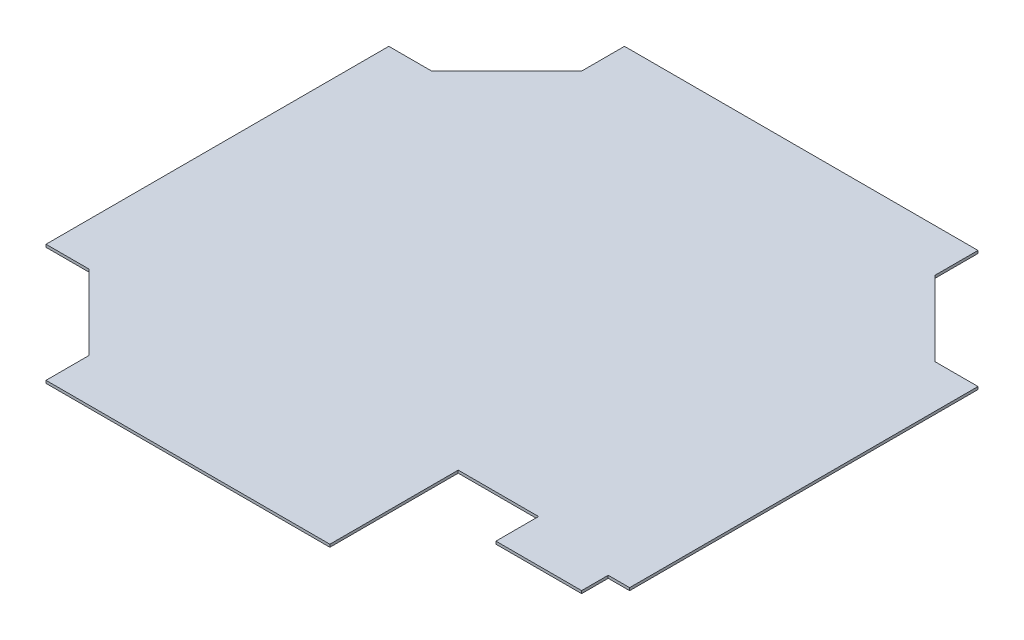
ISO-10303-21;
HEADER;
FILE_DESCRIPTION(('STEP AP214'),'2;1');
FILE_NAME('part.step','',(''),(''),'','','');
FILE_SCHEMA(('AUTOMOTIVE_DESIGN { 1 0 10303 214 1 1 1 1 }'));
ENDSEC;
DATA;
#1=APPLICATION_CONTEXT('core data for automotive mechanical design processes');
#2=APPLICATION_PROTOCOL_DEFINITION('international standard','automotive_design',2000,#1);
#3=PRODUCT_CONTEXT('',#1,'mechanical');
#4=PRODUCT('Part','Part','',(#3));
#5=PRODUCT_RELATED_PRODUCT_CATEGORY('part','',(#4));
#6=PRODUCT_DEFINITION_FORMATION('','',#4);
#7=PRODUCT_DEFINITION_CONTEXT('part definition',#1,'design');
#8=PRODUCT_DEFINITION('design','',#6,#7);
#9=PRODUCT_DEFINITION_SHAPE('','',#8);
#10=(LENGTH_UNIT() NAMED_UNIT(*) SI_UNIT(.MILLI.,.METRE.));
#11=(NAMED_UNIT(*) PLANE_ANGLE_UNIT() SI_UNIT($,.RADIAN.));
#12=(NAMED_UNIT(*) SI_UNIT($,.STERADIAN.) SOLID_ANGLE_UNIT());
#13=UNCERTAINTY_MEASURE_WITH_UNIT(LENGTH_MEASURE(1.E-05),#10,'distance_accuracy_value','');
#14=(GEOMETRIC_REPRESENTATION_CONTEXT(3) GLOBAL_UNCERTAINTY_ASSIGNED_CONTEXT((#13)) GLOBAL_UNIT_ASSIGNED_CONTEXT((#10,
#11,#12)) REPRESENTATION_CONTEXT('',''));
#15=CARTESIAN_POINT('',(0.,0.,0.));
#16=DIRECTION('',(0.,0.,1.));
#17=DIRECTION('',(1.,0.,0.));
#18=AXIS2_PLACEMENT_3D('',#15,#16,#17);
#19=CARTESIAN_POINT('',(349.25,3.175,342.9));
#20=DIRECTION('',(-1.,0.,0.));
#21=DIRECTION('',(0.,0.,1.));
#22=AXIS2_PLACEMENT_3D('',#19,#20,#21);
#23=PLANE('',#22);
#24=DIRECTION('',(0.,0.,-1.));
#25=VECTOR('',#24,1.);
#26=CARTESIAN_POINT('',(349.25,3.175,342.9));
#27=LINE('',#26,#25);
#28=CARTESIAN_POINT('',(349.25,3.17500000000009,209.804));
#29=VERTEX_POINT('',#28);
#30=CARTESIAN_POINT('',(349.25,3.175,-203.2));
#31=VERTEX_POINT('',#30);
#32=EDGE_CURVE('E302',#29,#31,#27,.T.);
#33=ORIENTED_EDGE('',*,*,#32,.F.);
#34=DIRECTION('',(0.,-1.,0.));
#35=VECTOR('',#34,1.);
#36=CARTESIAN_POINT('',(349.25,3.175,209.804));
#37=LINE('',#36,#35);
#38=CARTESIAN_POINT('',(349.25,0.,209.804));
#39=VERTEX_POINT('',#38);
#40=EDGE_CURVE('E221',#29,#39,#37,.T.);
#41=ORIENTED_EDGE('',*,*,#40,.T.);
#42=DIRECTION('',(0.,0.,-1.));
#43=VECTOR('',#42,1.);
#44=CARTESIAN_POINT('',(349.25,0.,342.9));
#45=LINE('',#44,#43);
#46=CARTESIAN_POINT('',(349.25,0.,-203.2));
#47=VERTEX_POINT('',#46);
#48=EDGE_CURVE('E296',#39,#47,#45,.T.);
#49=ORIENTED_EDGE('',*,*,#48,.T.);
#50=DIRECTION('',(0.,1.,0.));
#51=VECTOR('',#50,1.);
#52=CARTESIAN_POINT('',(349.25,0.,-203.2));
#53=LINE('',#52,#51);
#54=EDGE_CURVE('E224',#47,#31,#53,.T.);
#55=ORIENTED_EDGE('',*,*,#54,.T.);
#56=EDGE_LOOP('',(#33,#41,#49,#55));
#57=FACE_BOUND('',#56,.T.);
#58=ADVANCED_FACE('F39',(#57),#23,.F.);
#59=CARTESIAN_POINT('',(-349.25,3.175,-342.9));
#60=DIRECTION('',(0.,0.,1.));
#61=DIRECTION('',(1.,0.,0.));
#62=AXIS2_PLACEMENT_3D('',#59,#60,#61);
#63=PLANE('',#62);
#64=DIRECTION('',(-1.,0.,0.));
#65=VECTOR('',#64,1.);
#66=CARTESIAN_POINT('',(-349.25,3.175,-342.9));
#67=LINE('',#66,#65);
#68=CARTESIAN_POINT('',(209.55,3.175,-342.9));
#69=VERTEX_POINT('',#68);
#70=CARTESIAN_POINT('',(-209.55,3.175,-342.9));
#71=VERTEX_POINT('',#70);
#72=EDGE_CURVE('E304',#69,#71,#67,.T.);
#73=ORIENTED_EDGE('',*,*,#72,.F.);
#74=DIRECTION('',(0.,1.,0.));
#75=VECTOR('',#74,1.);
#76=CARTESIAN_POINT('',(209.55,0.,-342.9));
#77=LINE('',#76,#75);
#78=CARTESIAN_POINT('',(209.55,0.,-342.9));
#79=VERTEX_POINT('',#78);
#80=EDGE_CURVE('E253',#79,#69,#77,.T.);
#81=ORIENTED_EDGE('',*,*,#80,.F.);
#82=DIRECTION('',(-1.,0.,0.));
#83=VECTOR('',#82,1.);
#84=CARTESIAN_POINT('',(-349.25,0.,-342.9));
#85=LINE('',#84,#83);
#86=CARTESIAN_POINT('',(-209.55,0.,-342.9));
#87=VERTEX_POINT('',#86);
#88=EDGE_CURVE('E314',#79,#87,#85,.T.);
#89=ORIENTED_EDGE('',*,*,#88,.T.);
#90=DIRECTION('',(0.,1.,0.));
#91=VECTOR('',#90,1.);
#92=CARTESIAN_POINT('',(-209.55,0.,-342.9));
#93=LINE('',#92,#91);
#94=EDGE_CURVE('E293',#87,#71,#93,.T.);
#95=ORIENTED_EDGE('',*,*,#94,.T.);
#96=EDGE_LOOP('',(#73,#81,#89,#95));
#97=FACE_BOUND('',#96,.T.);
#98=ADVANCED_FACE('F356',(#97),#63,.F.);
#99=CARTESIAN_POINT('',(-349.25,3.175,342.9));
#100=DIRECTION('',(1.,0.,0.));
#101=DIRECTION('',(0.,0.,-1.));
#102=AXIS2_PLACEMENT_3D('',#99,#100,#101);
#103=PLANE('',#102);
#104=DIRECTION('',(0.,0.,1.));
#105=VECTOR('',#104,1.);
#106=CARTESIAN_POINT('',(-349.25,0.,342.9));
#107=LINE('',#106,#105);
#108=CARTESIAN_POINT('',(-349.25,0.,-203.2));
#109=VERTEX_POINT('',#108);
#110=CARTESIAN_POINT('',(-349.25,0.,203.2));
#111=VERTEX_POINT('',#110);
#112=EDGE_CURVE('E317',#109,#111,#107,.T.);
#113=ORIENTED_EDGE('',*,*,#112,.T.);
#114=DIRECTION('',(0.,1.,0.));
#115=VECTOR('',#114,1.);
#116=CARTESIAN_POINT('',(-349.25,0.,203.2));
#117=LINE('',#116,#115);
#118=CARTESIAN_POINT('',(-349.25,3.175,203.2));
#119=VERTEX_POINT('',#118);
#120=EDGE_CURVE('E232',#111,#119,#117,.T.);
#121=ORIENTED_EDGE('',*,*,#120,.T.);
#122=DIRECTION('',(0.,0.,1.));
#123=VECTOR('',#122,1.);
#124=CARTESIAN_POINT('',(-349.25,3.175,342.9));
#125=LINE('',#124,#123);
#126=CARTESIAN_POINT('',(-349.25,3.175,-203.2));
#127=VERTEX_POINT('',#126);
#128=EDGE_CURVE('E308',#127,#119,#125,.T.);
#129=ORIENTED_EDGE('',*,*,#128,.F.);
#130=DIRECTION('',(0.,1.,0.));
#131=VECTOR('',#130,1.);
#132=CARTESIAN_POINT('',(-349.25,0.,-203.2));
#133=LINE('',#132,#131);
#134=EDGE_CURVE('E286',#109,#127,#133,.T.);
#135=ORIENTED_EDGE('',*,*,#134,.F.);
#136=EDGE_LOOP('',(#113,#121,#129,#135));
#137=FACE_BOUND('',#136,.T.);
#138=ADVANCED_FACE('F337',(#137),#103,.F.);
#139=CARTESIAN_POINT('',(-349.25,3.175,342.9));
#140=DIRECTION('',(0.,0.,-1.));
#141=DIRECTION('',(-1.,0.,0.));
#142=AXIS2_PLACEMENT_3D('',#139,#140,#141);
#143=PLANE('',#142);
#144=DIRECTION('',(1.,0.,0.));
#145=VECTOR('',#144,1.);
#146=CARTESIAN_POINT('',(-349.25,0.,342.9));
#147=LINE('',#146,#145);
#148=CARTESIAN_POINT('',(-209.55,0.,342.9));
#149=VERTEX_POINT('',#148);
#150=CARTESIAN_POINT('',(126.999999999999,0.,342.9));
#151=VERTEX_POINT('',#150);
#152=EDGE_CURVE('E305',#149,#151,#147,.T.);
#153=ORIENTED_EDGE('',*,*,#152,.T.);
#154=DIRECTION('',(0.,1.,0.));
#155=VECTOR('',#154,1.);
#156=CARTESIAN_POINT('',(126.999999999999,3.175,342.9));
#157=LINE('',#156,#155);
#158=CARTESIAN_POINT('',(126.999999999999,3.17500000000009,342.9));
#159=VERTEX_POINT('',#158);
#160=EDGE_CURVE('E53',#151,#159,#157,.T.);
#161=ORIENTED_EDGE('',*,*,#160,.T.);
#162=DIRECTION('',(1.,0.,0.));
#163=VECTOR('',#162,1.);
#164=CARTESIAN_POINT('',(-349.25,3.175,342.9));
#165=LINE('',#164,#163);
#166=CARTESIAN_POINT('',(-209.55,3.175,342.9));
#167=VERTEX_POINT('',#166);
#168=EDGE_CURVE('E46',#167,#159,#165,.T.);
#169=ORIENTED_EDGE('',*,*,#168,.F.);
#170=DIRECTION('',(0.,1.,0.));
#171=VECTOR('',#170,1.);
#172=CARTESIAN_POINT('',(-209.55,0.,342.9));
#173=LINE('',#172,#171);
#174=EDGE_CURVE('E225',#149,#167,#173,.T.);
#175=ORIENTED_EDGE('',*,*,#174,.F.);
#176=EDGE_LOOP('',(#153,#161,#169,#175));
#177=FACE_BOUND('',#176,.T.);
#178=ADVANCED_FACE('F321',(#177),#143,.F.);
#179=CARTESIAN_POINT('',(0.,3.175,0.));
#180=DIRECTION('',(0.,-1.,0.));
#181=DIRECTION('',(0.,0.,-1.));
#182=AXIS2_PLACEMENT_3D('',#179,#180,#181);
#183=PLANE('',#182);
#184=DIRECTION('',(0.,0.,1.));
#185=VECTOR('',#184,1.);
#186=CARTESIAN_POINT('',(323.85,3.17500000000009,209.804));
#187=LINE('',#186,#185);
#188=CARTESIAN_POINT('',(323.85,3.17500000000009,209.804));
#189=VERTEX_POINT('',#188);
#190=CARTESIAN_POINT('',(323.85,3.17500000000009,241.3));
#191=VERTEX_POINT('',#190);
#192=EDGE_CURVE('E207',#189,#191,#187,.T.);
#193=ORIENTED_EDGE('',*,*,#192,.F.);
#194=DIRECTION('',(-1.,0.,0.));
#195=VECTOR('',#194,1.);
#196=CARTESIAN_POINT('',(361.95,3.17500000000009,209.804));
#197=LINE('',#196,#195);
#198=EDGE_CURVE('E205',#29,#189,#197,.T.);
#199=ORIENTED_EDGE('',*,*,#198,.F.);
#200=ORIENTED_EDGE('',*,*,#32,.T.);
#201=DIRECTION('',(1.,0.,0.));
#202=VECTOR('',#201,1.);
#203=CARTESIAN_POINT('',(349.25,3.175,-203.2));
#204=LINE('',#203,#202);
#205=CARTESIAN_POINT('',(298.45,3.175,-203.2));
#206=VERTEX_POINT('',#205);
#207=EDGE_CURVE('E262',#206,#31,#204,.T.);
#208=ORIENTED_EDGE('',*,*,#207,.F.);
#209=DIRECTION('',(0.707106781186548,0.,0.707106781186547));
#210=VECTOR('',#209,1.);
#211=CARTESIAN_POINT('',(298.45,3.175,-203.2));
#212=LINE('',#211,#210);
#213=CARTESIAN_POINT('',(209.55,3.175,-292.1));
#214=VERTEX_POINT('',#213);
#215=EDGE_CURVE('E265',#214,#206,#212,.T.);
#216=ORIENTED_EDGE('',*,*,#215,.F.);
#217=DIRECTION('',(0.,0.,1.));
#218=VECTOR('',#217,1.);
#219=CARTESIAN_POINT('',(209.55,3.175,-342.9));
#220=LINE('',#219,#218);
#221=EDGE_CURVE('E235',#69,#214,#220,.T.);
#222=ORIENTED_EDGE('',*,*,#221,.F.);
#223=ORIENTED_EDGE('',*,*,#72,.T.);
#224=DIRECTION('',(0.,0.,-1.));
#225=VECTOR('',#224,1.);
#226=CARTESIAN_POINT('',(-209.55,3.175,-342.9));
#227=LINE('',#226,#225);
#228=CARTESIAN_POINT('',(-209.55,3.175,-292.1));
#229=VERTEX_POINT('',#228);
#230=EDGE_CURVE('E280',#229,#71,#227,.T.);
#231=ORIENTED_EDGE('',*,*,#230,.F.);
#232=DIRECTION('',(0.707106781186548,0.,-0.707106781186547));
#233=VECTOR('',#232,1.);
#234=CARTESIAN_POINT('',(-298.45,3.175,-203.2));
#235=LINE('',#234,#233);
#236=CARTESIAN_POINT('',(-298.45,3.175,-203.2));
#237=VERTEX_POINT('',#236);
#238=EDGE_CURVE('E289',#237,#229,#235,.T.);
#239=ORIENTED_EDGE('',*,*,#238,.F.);
#240=DIRECTION('',(1.,0.,0.));
#241=VECTOR('',#240,1.);
#242=CARTESIAN_POINT('',(-349.25,3.175,-203.2));
#243=LINE('',#242,#241);
#244=EDGE_CURVE('E245',#127,#237,#243,.T.);
#245=ORIENTED_EDGE('',*,*,#244,.F.);
#246=ORIENTED_EDGE('',*,*,#128,.T.);
#247=DIRECTION('',(-1.,0.,0.));
#248=VECTOR('',#247,1.);
#249=CARTESIAN_POINT('',(-349.25,3.175,203.2));
#250=LINE('',#249,#248);
#251=CARTESIAN_POINT('',(-298.45,3.175,203.2));
#252=VERTEX_POINT('',#251);
#253=EDGE_CURVE('E236',#252,#119,#250,.T.);
#254=ORIENTED_EDGE('',*,*,#253,.F.);
#255=DIRECTION('',(-0.707106781186548,0.,-0.707106781186547));
#256=VECTOR('',#255,1.);
#257=CARTESIAN_POINT('',(-298.45,3.175,203.2));
#258=LINE('',#257,#256);
#259=CARTESIAN_POINT('',(-209.55,3.175,292.1));
#260=VERTEX_POINT('',#259);
#261=EDGE_CURVE('E238',#260,#252,#258,.T.);
#262=ORIENTED_EDGE('',*,*,#261,.F.);
#263=DIRECTION('',(0.,0.,-1.));
#264=VECTOR('',#263,1.);
#265=CARTESIAN_POINT('',(-209.55,3.175,342.9));
#266=LINE('',#265,#264);
#267=EDGE_CURVE('E242',#167,#260,#266,.T.);
#268=ORIENTED_EDGE('',*,*,#267,.F.);
#269=ORIENTED_EDGE('',*,*,#168,.T.);
#270=DIRECTION('',(0.,0.,1.));
#271=VECTOR('',#270,1.);
#272=CARTESIAN_POINT('',(126.999999999999,3.17500000000009,190.754));
#273=LINE('',#272,#271);
#274=CARTESIAN_POINT('',(126.999999999999,3.17500000000009,190.754));
#275=VERTEX_POINT('',#274);
#276=EDGE_CURVE('E203',#275,#159,#273,.T.);
#277=ORIENTED_EDGE('',*,*,#276,.F.);
#278=DIRECTION('',(-1.,0.,0.));
#279=VECTOR('',#278,1.);
#280=CARTESIAN_POINT('',(222.25,3.17500000000009,190.754));
#281=LINE('',#280,#279);
#282=CARTESIAN_POINT('',(222.25,3.17500000000009,190.754));
#283=VERTEX_POINT('',#282);
#284=EDGE_CURVE('E175',#283,#275,#281,.T.);
#285=ORIENTED_EDGE('',*,*,#284,.F.);
#286=DIRECTION('',(0.,0.,-1.));
#287=VECTOR('',#286,1.);
#288=CARTESIAN_POINT('',(222.25,3.17500000000009,241.3));
#289=LINE('',#288,#287);
#290=CARTESIAN_POINT('',(222.25,3.17500000000009,241.3));
#291=VERTEX_POINT('',#290);
#292=EDGE_CURVE('E191',#291,#283,#289,.T.);
#293=ORIENTED_EDGE('',*,*,#292,.F.);
#294=DIRECTION('',(-1.,0.,0.));
#295=VECTOR('',#294,1.);
#296=CARTESIAN_POINT('',(323.85,3.17500000000009,241.3));
#297=LINE('',#296,#295);
#298=EDGE_CURVE('E194',#191,#291,#297,.T.);
#299=ORIENTED_EDGE('',*,*,#298,.F.);
#300=EDGE_LOOP('',(#193,#199,#200,#208,#216,#222,#223,#231,#239,#245,#246,#254,#262,#268,#269,
#277,#285,#293,#299));
#301=FACE_BOUND('',#300,.T.);
#302=ADVANCED_FACE('F346',(#301),#183,.F.);
#303=CARTESIAN_POINT('',(0.,0.,0.));
#304=DIRECTION('',(0.,-1.,0.));
#305=DIRECTION('',(0.,0.,-1.));
#306=AXIS2_PLACEMENT_3D('',#303,#304,#305);
#307=PLANE('',#306);
#308=DIRECTION('',(1.,0.,0.));
#309=VECTOR('',#308,1.);
#310=CARTESIAN_POINT('',(0.,0.,209.804));
#311=LINE('',#310,#309);
#312=CARTESIAN_POINT('',(323.85,0.,209.804));
#313=VERTEX_POINT('',#312);
#314=EDGE_CURVE('E11',#313,#39,#311,.T.);
#315=ORIENTED_EDGE('',*,*,#314,.F.);
#316=DIRECTION('',(0.,0.,1.));
#317=VECTOR('',#316,1.);
#318=CARTESIAN_POINT('',(323.85,0.,209.804));
#319=LINE('',#318,#317);
#320=CARTESIAN_POINT('',(323.85,0.,241.3));
#321=VERTEX_POINT('',#320);
#322=EDGE_CURVE('E185',#313,#321,#319,.T.);
#323=ORIENTED_EDGE('',*,*,#322,.T.);
#324=DIRECTION('',(-1.,0.,0.));
#325=VECTOR('',#324,1.);
#326=CARTESIAN_POINT('',(323.85,0.,241.3));
#327=LINE('',#326,#325);
#328=CARTESIAN_POINT('',(222.25,0.,241.3));
#329=VERTEX_POINT('',#328);
#330=EDGE_CURVE('E199',#321,#329,#327,.T.);
#331=ORIENTED_EDGE('',*,*,#330,.T.);
#332=DIRECTION('',(0.,0.,-1.));
#333=VECTOR('',#332,1.);
#334=CARTESIAN_POINT('',(222.25,0.,241.3));
#335=LINE('',#334,#333);
#336=CARTESIAN_POINT('',(222.25,0.,190.754));
#337=VERTEX_POINT('',#336);
#338=EDGE_CURVE('E178',#329,#337,#335,.T.);
#339=ORIENTED_EDGE('',*,*,#338,.T.);
#340=DIRECTION('',(-1.,0.,0.));
#341=VECTOR('',#340,1.);
#342=CARTESIAN_POINT('',(222.25,0.,190.754));
#343=LINE('',#342,#341);
#344=CARTESIAN_POINT('',(126.999999999999,0.,190.754));
#345=VERTEX_POINT('',#344);
#346=EDGE_CURVE('E172',#337,#345,#343,.T.);
#347=ORIENTED_EDGE('',*,*,#346,.T.);
#348=DIRECTION('',(0.,0.,1.));
#349=VECTOR('',#348,1.);
#350=CARTESIAN_POINT('',(126.999999999999,0.,190.754));
#351=LINE('',#350,#349);
#352=EDGE_CURVE('E180',#345,#151,#351,.T.);
#353=ORIENTED_EDGE('',*,*,#352,.T.);
#354=ORIENTED_EDGE('',*,*,#152,.F.);
#355=DIRECTION('',(0.,0.,-1.));
#356=VECTOR('',#355,1.);
#357=CARTESIAN_POINT('',(-209.55,0.,342.9));
#358=LINE('',#357,#356);
#359=CARTESIAN_POINT('',(-209.55,0.,292.1));
#360=VERTEX_POINT('',#359);
#361=EDGE_CURVE('E239',#149,#360,#358,.T.);
#362=ORIENTED_EDGE('',*,*,#361,.T.);
#363=DIRECTION('',(-0.707106781186548,0.,-0.707106781186547));
#364=VECTOR('',#363,1.);
#365=CARTESIAN_POINT('',(-298.45,0.,203.2));
#366=LINE('',#365,#364);
#367=CARTESIAN_POINT('',(-298.45,0.,203.2));
#368=VERTEX_POINT('',#367);
#369=EDGE_CURVE('E248',#360,#368,#366,.T.);
#370=ORIENTED_EDGE('',*,*,#369,.T.);
#371=DIRECTION('',(-1.,0.,0.));
#372=VECTOR('',#371,1.);
#373=CARTESIAN_POINT('',(-349.25,0.,203.2));
#374=LINE('',#373,#372);
#375=EDGE_CURVE('E227',#368,#111,#374,.T.);
#376=ORIENTED_EDGE('',*,*,#375,.T.);
#377=ORIENTED_EDGE('',*,*,#112,.F.);
#378=DIRECTION('',(1.,0.,0.));
#379=VECTOR('',#378,1.);
#380=CARTESIAN_POINT('',(-349.25,0.,-203.2));
#381=LINE('',#380,#379);
#382=CARTESIAN_POINT('',(-298.45,0.,-203.2));
#383=VERTEX_POINT('',#382);
#384=EDGE_CURVE('E276',#109,#383,#381,.T.);
#385=ORIENTED_EDGE('',*,*,#384,.T.);
#386=DIRECTION('',(0.707106781186548,0.,-0.707106781186547));
#387=VECTOR('',#386,1.);
#388=CARTESIAN_POINT('',(-298.45,0.,-203.2));
#389=LINE('',#388,#387);
#390=CARTESIAN_POINT('',(-209.55,0.,-292.1));
#391=VERTEX_POINT('',#390);
#392=EDGE_CURVE('E279',#383,#391,#389,.T.);
#393=ORIENTED_EDGE('',*,*,#392,.T.);
#394=DIRECTION('',(0.,0.,-1.));
#395=VECTOR('',#394,1.);
#396=CARTESIAN_POINT('',(-209.55,0.,-342.9));
#397=LINE('',#396,#395);
#398=EDGE_CURVE('E283',#391,#87,#397,.T.);
#399=ORIENTED_EDGE('',*,*,#398,.T.);
#400=ORIENTED_EDGE('',*,*,#88,.F.);
#401=DIRECTION('',(0.,0.,1.));
#402=VECTOR('',#401,1.);
#403=CARTESIAN_POINT('',(209.55,0.,-342.9));
#404=LINE('',#403,#402);
#405=CARTESIAN_POINT('',(209.55,0.,-292.1));
#406=VERTEX_POINT('',#405);
#407=EDGE_CURVE('E266',#79,#406,#404,.T.);
#408=ORIENTED_EDGE('',*,*,#407,.T.);
#409=DIRECTION('',(0.707106781186548,0.,0.707106781186547));
#410=VECTOR('',#409,1.);
#411=CARTESIAN_POINT('',(298.45,0.,-203.2));
#412=LINE('',#411,#410);
#413=CARTESIAN_POINT('',(298.45,0.,-203.2));
#414=VERTEX_POINT('',#413);
#415=EDGE_CURVE('E61',#406,#414,#412,.T.);
#416=ORIENTED_EDGE('',*,*,#415,.T.);
#417=DIRECTION('',(1.,0.,0.));
#418=VECTOR('',#417,1.);
#419=CARTESIAN_POINT('',(349.25,0.,-203.2));
#420=LINE('',#419,#418);
#421=EDGE_CURVE('E255',#414,#47,#420,.T.);
#422=ORIENTED_EDGE('',*,*,#421,.T.);
#423=ORIENTED_EDGE('',*,*,#48,.F.);
#424=EDGE_LOOP('',(#315,#323,#331,#339,#347,#353,#354,#362,#370,#376,#377,#385,#393,#399,#400,
#408,#416,#422,#423));
#425=FACE_BOUND('',#424,.T.);
#426=ADVANCED_FACE('F188',(#425),#307,.T.);
#427=CARTESIAN_POINT('',(-209.55,0.,-342.9));
#428=DIRECTION('',(1.,0.,0.));
#429=DIRECTION('',(0.,0.,-1.));
#430=AXIS2_PLACEMENT_3D('',#427,#428,#429);
#431=PLANE('',#430);
#432=ORIENTED_EDGE('',*,*,#230,.T.);
#433=ORIENTED_EDGE('',*,*,#94,.F.);
#434=ORIENTED_EDGE('',*,*,#398,.F.);
#435=DIRECTION('',(0.,1.,0.));
#436=VECTOR('',#435,1.);
#437=CARTESIAN_POINT('',(-209.55,0.,-292.1));
#438=LINE('',#437,#436);
#439=EDGE_CURVE('E297',#391,#229,#438,.T.);
#440=ORIENTED_EDGE('',*,*,#439,.T.);
#441=EDGE_LOOP('',(#432,#433,#434,#440));
#442=FACE_BOUND('',#441,.T.);
#443=ADVANCED_FACE('F405',(#442),#431,.F.);
#444=CARTESIAN_POINT('',(-298.45,0.,-203.2));
#445=DIRECTION('',(0.707106781186547,0.,0.707106781186548));
#446=DIRECTION('',(0.707106781186548,0.,-0.707106781186547));
#447=AXIS2_PLACEMENT_3D('',#444,#445,#446);
#448=PLANE('',#447);
#449=ORIENTED_EDGE('',*,*,#238,.T.);
#450=ORIENTED_EDGE('',*,*,#439,.F.);
#451=ORIENTED_EDGE('',*,*,#392,.F.);
#452=DIRECTION('',(0.,1.,0.));
#453=VECTOR('',#452,1.);
#454=CARTESIAN_POINT('',(-298.45,0.,-203.2));
#455=LINE('',#454,#453);
#456=EDGE_CURVE('E299',#383,#237,#455,.T.);
#457=ORIENTED_EDGE('',*,*,#456,.T.);
#458=EDGE_LOOP('',(#449,#450,#451,#457));
#459=FACE_BOUND('',#458,.T.);
#460=ADVANCED_FACE('F349',(#459),#448,.F.);
#461=CARTESIAN_POINT('',(-349.25,0.,-203.2));
#462=DIRECTION('',(0.,0.,1.));
#463=DIRECTION('',(1.,0.,0.));
#464=AXIS2_PLACEMENT_3D('',#461,#462,#463);
#465=PLANE('',#464);
#466=ORIENTED_EDGE('',*,*,#244,.T.);
#467=ORIENTED_EDGE('',*,*,#456,.F.);
#468=ORIENTED_EDGE('',*,*,#384,.F.);
#469=ORIENTED_EDGE('',*,*,#134,.T.);
#470=EDGE_LOOP('',(#466,#467,#468,#469));
#471=FACE_BOUND('',#470,.T.);
#472=ADVANCED_FACE('F341',(#471),#465,.F.);
#473=CARTESIAN_POINT('',(-349.25,0.,203.2));
#474=DIRECTION('',(0.,0.,-1.));
#475=DIRECTION('',(-1.,0.,0.));
#476=AXIS2_PLACEMENT_3D('',#473,#474,#475);
#477=PLANE('',#476);
#478=ORIENTED_EDGE('',*,*,#253,.T.);
#479=ORIENTED_EDGE('',*,*,#120,.F.);
#480=ORIENTED_EDGE('',*,*,#375,.F.);
#481=DIRECTION('',(0.,1.,0.));
#482=VECTOR('',#481,1.);
#483=CARTESIAN_POINT('',(-298.45,0.,203.2));
#484=LINE('',#483,#482);
#485=EDGE_CURVE('E230',#368,#252,#484,.T.);
#486=ORIENTED_EDGE('',*,*,#485,.T.);
#487=EDGE_LOOP('',(#478,#479,#480,#486));
#488=FACE_BOUND('',#487,.T.);
#489=ADVANCED_FACE('F333',(#488),#477,.F.);
#490=CARTESIAN_POINT('',(-298.45,0.,203.2));
#491=DIRECTION('',(0.707106781186547,0.,-0.707106781186548));
#492=DIRECTION('',(-0.707106781186548,0.,-0.707106781186547));
#493=AXIS2_PLACEMENT_3D('',#490,#491,#492);
#494=PLANE('',#493);
#495=ORIENTED_EDGE('',*,*,#261,.T.);
#496=ORIENTED_EDGE('',*,*,#485,.F.);
#497=ORIENTED_EDGE('',*,*,#369,.F.);
#498=DIRECTION('',(0.,1.,0.));
#499=VECTOR('',#498,1.);
#500=CARTESIAN_POINT('',(-209.55,0.,292.1));
#501=LINE('',#500,#499);
#502=EDGE_CURVE('E228',#360,#260,#501,.T.);
#503=ORIENTED_EDGE('',*,*,#502,.T.);
#504=EDGE_LOOP('',(#495,#496,#497,#503));
#505=FACE_BOUND('',#504,.T.);
#506=ADVANCED_FACE('F329',(#505),#494,.F.);
#507=CARTESIAN_POINT('',(-209.55,0.,342.9));
#508=DIRECTION('',(1.,0.,0.));
#509=DIRECTION('',(0.,0.,-1.));
#510=AXIS2_PLACEMENT_3D('',#507,#508,#509);
#511=PLANE('',#510);
#512=ORIENTED_EDGE('',*,*,#267,.T.);
#513=ORIENTED_EDGE('',*,*,#502,.F.);
#514=ORIENTED_EDGE('',*,*,#361,.F.);
#515=ORIENTED_EDGE('',*,*,#174,.T.);
#516=EDGE_LOOP('',(#512,#513,#514,#515));
#517=FACE_BOUND('',#516,.T.);
#518=ADVANCED_FACE('F325',(#517),#511,.F.);
#519=CARTESIAN_POINT('',(349.25,0.,-203.2));
#520=DIRECTION('',(0.,0.,1.));
#521=DIRECTION('',(1.,0.,0.));
#522=AXIS2_PLACEMENT_3D('',#519,#520,#521);
#523=PLANE('',#522);
#524=ORIENTED_EDGE('',*,*,#207,.T.);
#525=ORIENTED_EDGE('',*,*,#54,.F.);
#526=ORIENTED_EDGE('',*,*,#421,.F.);
#527=DIRECTION('',(0.,1.,0.));
#528=VECTOR('',#527,1.);
#529=CARTESIAN_POINT('',(298.45,0.,-203.2));
#530=LINE('',#529,#528);
#531=EDGE_CURVE('E258',#414,#206,#530,.T.);
#532=ORIENTED_EDGE('',*,*,#531,.T.);
#533=EDGE_LOOP('',(#524,#525,#526,#532));
#534=FACE_BOUND('',#533,.T.);
#535=ADVANCED_FACE('F367',(#534),#523,.F.);
#536=CARTESIAN_POINT('',(298.45,0.,-203.2));
#537=DIRECTION('',(-0.707106781186547,0.,0.707106781186548));
#538=DIRECTION('',(0.707106781186548,0.,0.707106781186547));
#539=AXIS2_PLACEMENT_3D('',#536,#537,#538);
#540=PLANE('',#539);
#541=ORIENTED_EDGE('',*,*,#215,.T.);
#542=ORIENTED_EDGE('',*,*,#531,.F.);
#543=ORIENTED_EDGE('',*,*,#415,.F.);
#544=DIRECTION('',(0.,1.,0.));
#545=VECTOR('',#544,1.);
#546=CARTESIAN_POINT('',(209.55,0.,-292.1));
#547=LINE('',#546,#545);
#548=EDGE_CURVE('E256',#406,#214,#547,.T.);
#549=ORIENTED_EDGE('',*,*,#548,.T.);
#550=EDGE_LOOP('',(#541,#542,#543,#549));
#551=FACE_BOUND('',#550,.T.);
#552=ADVANCED_FACE('F362',(#551),#540,.F.);
#553=CARTESIAN_POINT('',(209.55,0.,-342.9));
#554=DIRECTION('',(-1.,0.,0.));
#555=DIRECTION('',(0.,0.,1.));
#556=AXIS2_PLACEMENT_3D('',#553,#554,#555);
#557=PLANE('',#556);
#558=ORIENTED_EDGE('',*,*,#221,.T.);
#559=ORIENTED_EDGE('',*,*,#548,.F.);
#560=ORIENTED_EDGE('',*,*,#407,.F.);
#561=ORIENTED_EDGE('',*,*,#80,.T.);
#562=EDGE_LOOP('',(#558,#559,#560,#561));
#563=FACE_BOUND('',#562,.T.);
#564=ADVANCED_FACE('F359',(#563),#557,.F.);
#565=CARTESIAN_POINT('',(361.95,0.,209.804));
#566=DIRECTION('',(0.,0.,-1.));
#567=DIRECTION('',(-1.,0.,0.));
#568=AXIS2_PLACEMENT_3D('',#565,#566,#567);
#569=PLANE('',#568);
#570=ORIENTED_EDGE('',*,*,#198,.T.);
#571=DIRECTION('',(0.,1.,0.));
#572=VECTOR('',#571,1.);
#573=CARTESIAN_POINT('',(323.85,0.,209.804));
#574=LINE('',#573,#572);
#575=EDGE_CURVE('E177',#313,#189,#574,.T.);
#576=ORIENTED_EDGE('',*,*,#575,.F.);
#577=ORIENTED_EDGE('',*,*,#314,.T.);
#578=ORIENTED_EDGE('',*,*,#40,.F.);
#579=EDGE_LOOP('',(#570,#576,#577,#578));
#580=FACE_BOUND('',#579,.T.);
#581=ADVANCED_FACE('F372',(#580),#569,.F.);
#582=CARTESIAN_POINT('',(126.999999999999,0.,190.754));
#583=DIRECTION('',(-1.,0.,0.));
#584=DIRECTION('',(0.,0.,1.));
#585=AXIS2_PLACEMENT_3D('',#582,#583,#584);
#586=PLANE('',#585);
#587=ORIENTED_EDGE('',*,*,#352,.F.);
#588=DIRECTION('',(0.,1.,0.));
#589=VECTOR('',#588,1.);
#590=CARTESIAN_POINT('',(126.999999999999,0.,190.754));
#591=LINE('',#590,#589);
#592=EDGE_CURVE('E169',#345,#275,#591,.T.);
#593=ORIENTED_EDGE('',*,*,#592,.T.);
#594=ORIENTED_EDGE('',*,*,#276,.T.);
#595=ORIENTED_EDGE('',*,*,#160,.F.);
#596=EDGE_LOOP('',(#587,#593,#594,#595));
#597=FACE_BOUND('',#596,.T.);
#598=ADVANCED_FACE('F181',(#597),#586,.F.);
#599=CARTESIAN_POINT('',(222.25,0.,190.754));
#600=DIRECTION('',(0.,0.,-1.));
#601=DIRECTION('',(-1.,0.,0.));
#602=AXIS2_PLACEMENT_3D('',#599,#600,#601);
#603=PLANE('',#602);
#604=ORIENTED_EDGE('',*,*,#284,.T.);
#605=ORIENTED_EDGE('',*,*,#592,.F.);
#606=ORIENTED_EDGE('',*,*,#346,.F.);
#607=DIRECTION('',(0.,1.,0.));
#608=VECTOR('',#607,1.);
#609=CARTESIAN_POINT('',(222.25,0.,190.754));
#610=LINE('',#609,#608);
#611=EDGE_CURVE('E212',#337,#283,#610,.T.);
#612=ORIENTED_EDGE('',*,*,#611,.T.);
#613=EDGE_LOOP('',(#604,#605,#606,#612));
#614=FACE_BOUND('',#613,.T.);
#615=ADVANCED_FACE('F170',(#614),#603,.F.);
#616=CARTESIAN_POINT('',(222.25,0.,241.3));
#617=DIRECTION('',(1.,0.,0.));
#618=DIRECTION('',(0.,0.,-1.));
#619=AXIS2_PLACEMENT_3D('',#616,#617,#618);
#620=PLANE('',#619);
#621=ORIENTED_EDGE('',*,*,#292,.T.);
#622=ORIENTED_EDGE('',*,*,#611,.F.);
#623=ORIENTED_EDGE('',*,*,#338,.F.);
#624=DIRECTION('',(0.,1.,0.));
#625=VECTOR('',#624,1.);
#626=CARTESIAN_POINT('',(222.25,0.,241.3));
#627=LINE('',#626,#625);
#628=EDGE_CURVE('E214',#329,#291,#627,.T.);
#629=ORIENTED_EDGE('',*,*,#628,.T.);
#630=EDGE_LOOP('',(#621,#622,#623,#629));
#631=FACE_BOUND('',#630,.T.);
#632=ADVANCED_FACE('F382',(#631),#620,.F.);
#633=CARTESIAN_POINT('',(323.85,0.,241.3));
#634=DIRECTION('',(0.,0.,-1.));
#635=DIRECTION('',(-1.,0.,0.));
#636=AXIS2_PLACEMENT_3D('',#633,#634,#635);
#637=PLANE('',#636);
#638=ORIENTED_EDGE('',*,*,#298,.T.);
#639=ORIENTED_EDGE('',*,*,#628,.F.);
#640=ORIENTED_EDGE('',*,*,#330,.F.);
#641=DIRECTION('',(0.,1.,0.));
#642=VECTOR('',#641,1.);
#643=CARTESIAN_POINT('',(323.85,0.,241.3));
#644=LINE('',#643,#642);
#645=EDGE_CURVE('E216',#321,#191,#644,.T.);
#646=ORIENTED_EDGE('',*,*,#645,.T.);
#647=EDGE_LOOP('',(#638,#639,#640,#646));
#648=FACE_BOUND('',#647,.T.);
#649=ADVANCED_FACE('F380',(#648),#637,.F.);
#650=CARTESIAN_POINT('',(323.85,0.,209.804));
#651=DIRECTION('',(-1.,0.,0.));
#652=DIRECTION('',(0.,0.,1.));
#653=AXIS2_PLACEMENT_3D('',#650,#651,#652);
#654=PLANE('',#653);
#655=ORIENTED_EDGE('',*,*,#192,.T.);
#656=ORIENTED_EDGE('',*,*,#645,.F.);
#657=ORIENTED_EDGE('',*,*,#322,.F.);
#658=ORIENTED_EDGE('',*,*,#575,.T.);
#659=EDGE_LOOP('',(#655,#656,#657,#658));
#660=FACE_BOUND('',#659,.T.);
#661=ADVANCED_FACE('F376',(#660),#654,.F.);
#662=CLOSED_SHELL('',(#58,#98,#138,#178,#302,#426,#443,#460,#472,#489,#506,#518,#535,#552,#564,
#581,#598,#615,#632,#649,#661));
#663=MANIFOLD_SOLID_BREP('B2',#662);
#664=ADVANCED_BREP_SHAPE_REPRESENTATION('',(#18,#663),#14);
#665=SHAPE_DEFINITION_REPRESENTATION(#9,#664);
ENDSEC;
END-ISO-10303-21;
